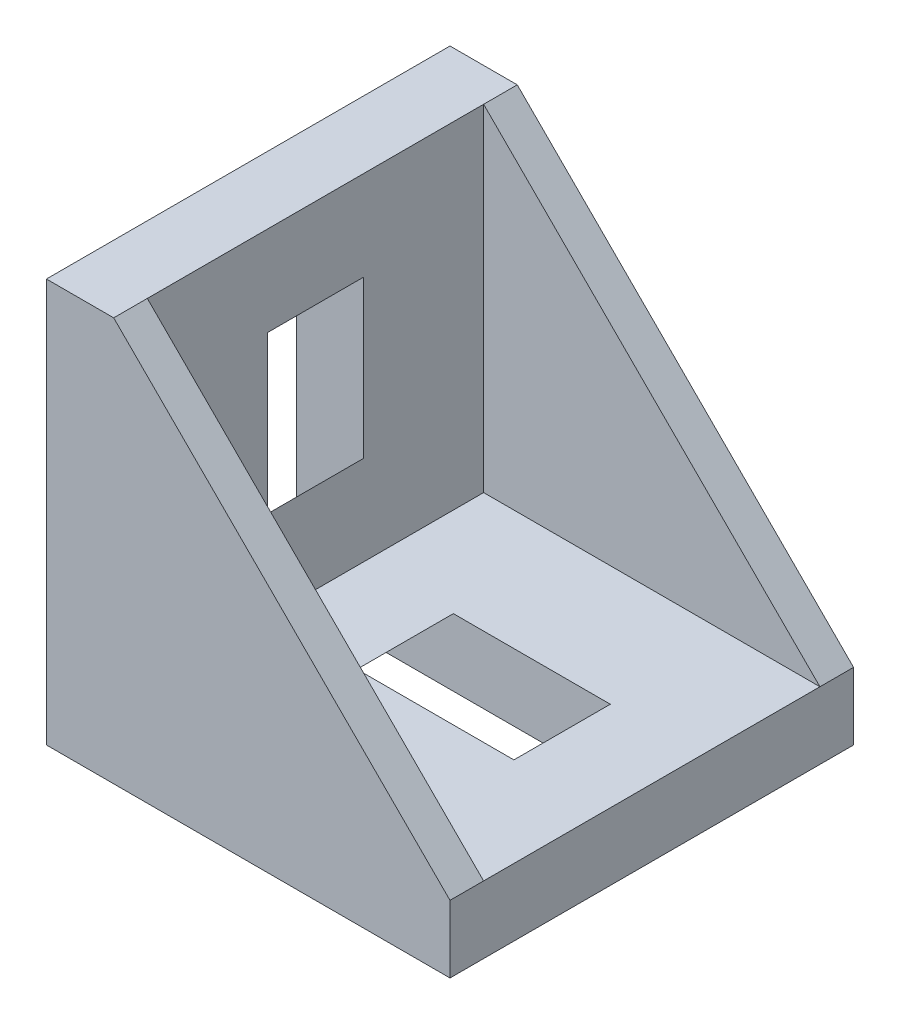
ISO-10303-21;
HEADER;
FILE_DESCRIPTION(('STEP AP214'),'2;1');
FILE_NAME('part.step','',(''),(''),'','','');
FILE_SCHEMA(('AUTOMOTIVE_DESIGN { 1 0 10303 214 1 1 1 1 }'));
ENDSEC;
DATA;
#1=APPLICATION_CONTEXT('core data for automotive mechanical design processes');
#2=APPLICATION_PROTOCOL_DEFINITION('international standard','automotive_design',2000,#1);
#3=PRODUCT_CONTEXT('',#1,'mechanical');
#4=PRODUCT('Part','Part','',(#3));
#5=PRODUCT_RELATED_PRODUCT_CATEGORY('part','',(#4));
#6=PRODUCT_DEFINITION_FORMATION('','',#4);
#7=PRODUCT_DEFINITION_CONTEXT('part definition',#1,'design');
#8=PRODUCT_DEFINITION('design','',#6,#7);
#9=PRODUCT_DEFINITION_SHAPE('','',#8);
#10=(LENGTH_UNIT() NAMED_UNIT(*) SI_UNIT(.MILLI.,.METRE.));
#11=(NAMED_UNIT(*) PLANE_ANGLE_UNIT() SI_UNIT($,.RADIAN.));
#12=(NAMED_UNIT(*) SI_UNIT($,.STERADIAN.) SOLID_ANGLE_UNIT());
#13=UNCERTAINTY_MEASURE_WITH_UNIT(LENGTH_MEASURE(1.E-05),#10,'distance_accuracy_value','');
#14=(GEOMETRIC_REPRESENTATION_CONTEXT(3) GLOBAL_UNCERTAINTY_ASSIGNED_CONTEXT((#13)) GLOBAL_UNIT_ASSIGNED_CONTEXT((#10,
#11,#12)) REPRESENTATION_CONTEXT('',''));
#15=CARTESIAN_POINT('',(0.,0.,0.));
#16=DIRECTION('',(0.,0.,1.));
#17=DIRECTION('',(1.,0.,0.));
#18=AXIS2_PLACEMENT_3D('',#15,#16,#17);
#19=CARTESIAN_POINT('',(0.,0.,9.));
#20=DIRECTION('',(1.,0.,0.));
#21=DIRECTION('',(0.,0.,-1.));
#22=AXIS2_PLACEMENT_3D('',#19,#20,#21);
#23=PLANE('',#22);
#24=DIRECTION('',(0.,0.,-1.));
#25=VECTOR('',#24,1.);
#26=CARTESIAN_POINT('',(0.,17.3,2.5));
#27=LINE('',#26,#25);
#28=CARTESIAN_POINT('',(0.,17.3,2.5));
#29=VERTEX_POINT('',#28);
#30=CARTESIAN_POINT('',(0.,17.3,-2.5));
#31=VERTEX_POINT('',#30);
#32=EDGE_CURVE('E376',#29,#31,#27,.T.);
#33=ORIENTED_EDGE('',*,*,#32,.F.);
#34=DIRECTION('',(0.,1.,0.));
#35=VECTOR('',#34,1.);
#36=CARTESIAN_POINT('',(0.,17.3,2.5));
#37=LINE('',#36,#35);
#38=CARTESIAN_POINT('',(0.,14.9992165715514,2.5));
#39=VERTEX_POINT('',#38);
#40=EDGE_CURVE('E372',#39,#29,#37,.T.);
#41=ORIENTED_EDGE('',*,*,#40,.F.);
#42=DIRECTION('',(0.,0.,-1.));
#43=VECTOR('',#42,1.);
#44=CARTESIAN_POINT('',(0.,14.9992165715514,2.5));
#45=LINE('',#44,#43);
#46=CARTESIAN_POINT('',(0.,14.9992165715514,-2.5));
#47=VERTEX_POINT('',#46);
#48=EDGE_CURVE('E392',#39,#47,#45,.T.);
#49=ORIENTED_EDGE('',*,*,#48,.T.);
#50=DIRECTION('',(0.,1.,0.));
#51=VECTOR('',#50,1.);
#52=CARTESIAN_POINT('',(0.,17.3,-2.5));
#53=LINE('',#52,#51);
#54=EDGE_CURVE('E365',#47,#31,#53,.T.);
#55=ORIENTED_EDGE('',*,*,#54,.T.);
#56=EDGE_LOOP('',(#33,#41,#49,#55));
#57=FACE_BOUND('',#56,.T.);
#58=DIRECTION('',(0.,-1.,0.));
#59=VECTOR('',#58,1.);
#60=CARTESIAN_POINT('',(0.,14.,-2.15));
#61=LINE('',#60,#59);
#62=CARTESIAN_POINT('',(0.,14.,-2.15));
#63=VERTEX_POINT('',#62);
#64=CARTESIAN_POINT('',(0.,4.,-2.15));
#65=VERTEX_POINT('',#64);
#66=EDGE_CURVE('E534',#63,#65,#61,.T.);
#67=ORIENTED_EDGE('',*,*,#66,.F.);
#68=DIRECTION('',(0.,0.,1.));
#69=VECTOR('',#68,1.);
#70=CARTESIAN_POINT('',(0.,14.,-2.15));
#71=LINE('',#70,#69);
#72=CARTESIAN_POINT('',(0.,14.,2.15));
#73=VERTEX_POINT('',#72);
#74=EDGE_CURVE('E565',#63,#73,#71,.T.);
#75=ORIENTED_EDGE('',*,*,#74,.T.);
#76=DIRECTION('',(0.,-1.,0.));
#77=VECTOR('',#76,1.);
#78=CARTESIAN_POINT('',(0.,14.,2.15));
#79=LINE('',#78,#77);
#80=CARTESIAN_POINT('',(0.,4.,2.15));
#81=VERTEX_POINT('',#80);
#82=EDGE_CURVE('E522',#73,#81,#79,.T.);
#83=ORIENTED_EDGE('',*,*,#82,.T.);
#84=DIRECTION('',(0.,0.,1.));
#85=VECTOR('',#84,1.);
#86=CARTESIAN_POINT('',(0.,4.,-2.15));
#87=LINE('',#86,#85);
#88=EDGE_CURVE('E550',#65,#81,#87,.T.);
#89=ORIENTED_EDGE('',*,*,#88,.F.);
#90=EDGE_LOOP('',(#67,#75,#83,#89));
#91=FACE_BOUND('',#90,.T.);
#92=DIRECTION('',(0.,-1.,0.));
#93=VECTOR('',#92,1.);
#94=CARTESIAN_POINT('',(0.,0.,-9.));
#95=LINE('',#94,#93);
#96=CARTESIAN_POINT('',(0.,18.,-9.));
#97=VERTEX_POINT('',#96);
#98=CARTESIAN_POINT('',(0.,0.,-9.));
#99=VERTEX_POINT('',#98);
#100=EDGE_CURVE('E619',#97,#99,#95,.T.);
#101=ORIENTED_EDGE('',*,*,#100,.T.);
#102=DIRECTION('',(0.,0.,-1.));
#103=VECTOR('',#102,1.);
#104=CARTESIAN_POINT('',(0.,0.,9.));
#105=LINE('',#104,#103);
#106=CARTESIAN_POINT('',(0.,0.,9.));
#107=VERTEX_POINT('',#106);
#108=EDGE_CURVE('E631',#107,#99,#105,.T.);
#109=ORIENTED_EDGE('',*,*,#108,.F.);
#110=DIRECTION('',(0.,-1.,0.));
#111=VECTOR('',#110,1.);
#112=CARTESIAN_POINT('',(0.,0.,9.));
#113=LINE('',#112,#111);
#114=CARTESIAN_POINT('',(0.,18.,9.));
#115=VERTEX_POINT('',#114);
#116=EDGE_CURVE('E628',#115,#107,#113,.T.);
#117=ORIENTED_EDGE('',*,*,#116,.F.);
#118=DIRECTION('',(0.,0.,-1.));
#119=VECTOR('',#118,1.);
#120=CARTESIAN_POINT('',(0.,18.,9.));
#121=LINE('',#120,#119);
#122=EDGE_CURVE('E651',#115,#97,#121,.T.);
#123=ORIENTED_EDGE('',*,*,#122,.T.);
#124=EDGE_LOOP('',(#101,#109,#117,#123));
#125=FACE_BOUND('',#124,.T.);
#126=DIRECTION('',(0.,1.,0.));
#127=VECTOR('',#126,1.);
#128=CARTESIAN_POINT('',(0.,1.23475047748417,2.5));
#129=LINE('',#128,#127);
#130=CARTESIAN_POINT('',(0.,1.23475047748417,2.5));
#131=VERTEX_POINT('',#130);
#132=CARTESIAN_POINT('',(0.,3.53553390593273,2.5));
#133=VERTEX_POINT('',#132);
#134=EDGE_CURVE('E404',#131,#133,#129,.T.);
#135=ORIENTED_EDGE('',*,*,#134,.F.);
#136=DIRECTION('',(0.,0.,-1.));
#137=VECTOR('',#136,1.);
#138=CARTESIAN_POINT('',(0.,1.23475047748417,2.5));
#139=LINE('',#138,#137);
#140=CARTESIAN_POINT('',(0.,1.23475047748417,-2.5));
#141=VERTEX_POINT('',#140);
#142=EDGE_CURVE('E418',#131,#141,#139,.T.);
#143=ORIENTED_EDGE('',*,*,#142,.T.);
#144=DIRECTION('',(0.,1.,0.));
#145=VECTOR('',#144,1.);
#146=CARTESIAN_POINT('',(0.,1.23475047748417,-2.5));
#147=LINE('',#146,#145);
#148=CARTESIAN_POINT('',(0.,3.53553390593273,-2.5));
#149=VERTEX_POINT('',#148);
#150=EDGE_CURVE('E403',#141,#149,#147,.T.);
#151=ORIENTED_EDGE('',*,*,#150,.T.);
#152=DIRECTION('',(0.,0.,-1.));
#153=VECTOR('',#152,1.);
#154=CARTESIAN_POINT('',(0.,3.53553390593273,2.5));
#155=LINE('',#154,#153);
#156=EDGE_CURVE('E441',#133,#149,#155,.T.);
#157=ORIENTED_EDGE('',*,*,#156,.F.);
#158=EDGE_LOOP('',(#135,#143,#151,#157));
#159=FACE_BOUND('',#158,.T.);
#160=ADVANCED_FACE('F40',(#57,#91,#125,#159),#23,.F.);
#161=CARTESIAN_POINT('',(18.,0.,9.));
#162=DIRECTION('',(0.,1.,0.));
#163=DIRECTION('',(-1.,0.,0.));
#164=AXIS2_PLACEMENT_3D('',#161,#162,#163);
#165=PLANE('',#164);
#166=DIRECTION('',(0.,0.,-1.));
#167=VECTOR('',#166,1.);
#168=CARTESIAN_POINT('',(14.9992165715514,0.,2.5));
#169=LINE('',#168,#167);
#170=CARTESIAN_POINT('',(14.9992165715514,0.,2.5));
#171=VERTEX_POINT('',#170);
#172=CARTESIAN_POINT('',(14.9992165715514,0.,-2.5));
#173=VERTEX_POINT('',#172);
#174=EDGE_CURVE('E59',#171,#173,#169,.T.);
#175=ORIENTED_EDGE('',*,*,#174,.F.);
#176=DIRECTION('',(-1.,0.,0.));
#177=VECTOR('',#176,1.);
#178=CARTESIAN_POINT('',(17.3,0.,2.5));
#179=LINE('',#178,#177);
#180=CARTESIAN_POINT('',(17.3,0.,2.5));
#181=VERTEX_POINT('',#180);
#182=EDGE_CURVE('E66',#181,#171,#179,.T.);
#183=ORIENTED_EDGE('',*,*,#182,.F.);
#184=DIRECTION('',(0.,0.,-1.));
#185=VECTOR('',#184,1.);
#186=CARTESIAN_POINT('',(17.3,0.,2.5));
#187=LINE('',#186,#185);
#188=CARTESIAN_POINT('',(17.3,0.,-2.5));
#189=VERTEX_POINT('',#188);
#190=EDGE_CURVE('E338',#181,#189,#187,.T.);
#191=ORIENTED_EDGE('',*,*,#190,.T.);
#192=DIRECTION('',(-1.,0.,0.));
#193=VECTOR('',#192,1.);
#194=CARTESIAN_POINT('',(17.3,0.,-2.5));
#195=LINE('',#194,#193);
#196=EDGE_CURVE('E342',#189,#173,#195,.T.);
#197=ORIENTED_EDGE('',*,*,#196,.T.);
#198=EDGE_LOOP('',(#175,#183,#191,#197));
#199=FACE_BOUND('',#198,.T.);
#200=DIRECTION('',(1.,0.,0.));
#201=VECTOR('',#200,1.);
#202=CARTESIAN_POINT('',(4.,0.,-2.15));
#203=LINE('',#202,#201);
#204=CARTESIAN_POINT('',(4.,0.,-2.15));
#205=VERTEX_POINT('',#204);
#206=CARTESIAN_POINT('',(14.,0.,-2.15));
#207=VERTEX_POINT('',#206);
#208=EDGE_CURVE('E491',#205,#207,#203,.T.);
#209=ORIENTED_EDGE('',*,*,#208,.F.);
#210=DIRECTION('',(0.,0.,1.));
#211=VECTOR('',#210,1.);
#212=CARTESIAN_POINT('',(4.,0.,-2.15));
#213=LINE('',#212,#211);
#214=CARTESIAN_POINT('',(4.,0.,2.15));
#215=VERTEX_POINT('',#214);
#216=EDGE_CURVE('E504',#205,#215,#213,.T.);
#217=ORIENTED_EDGE('',*,*,#216,.T.);
#218=DIRECTION('',(1.,0.,0.));
#219=VECTOR('',#218,1.);
#220=CARTESIAN_POINT('',(4.,0.,2.15));
#221=LINE('',#220,#219);
#222=CARTESIAN_POINT('',(14.,0.,2.15));
#223=VERTEX_POINT('',#222);
#224=EDGE_CURVE('E508',#215,#223,#221,.T.);
#225=ORIENTED_EDGE('',*,*,#224,.T.);
#226=DIRECTION('',(0.,0.,1.));
#227=VECTOR('',#226,1.);
#228=CARTESIAN_POINT('',(14.,0.,-2.15));
#229=LINE('',#228,#227);
#230=EDGE_CURVE('E527',#207,#223,#229,.T.);
#231=ORIENTED_EDGE('',*,*,#230,.F.);
#232=EDGE_LOOP('',(#209,#217,#225,#231));
#233=FACE_BOUND('',#232,.T.);
#234=DIRECTION('',(1.,0.,0.));
#235=VECTOR('',#234,1.);
#236=CARTESIAN_POINT('',(18.,0.,-9.));
#237=LINE('',#236,#235);
#238=CARTESIAN_POINT('',(18.,0.,-9.));
#239=VERTEX_POINT('',#238);
#240=EDGE_CURVE('E608',#99,#239,#237,.T.);
#241=ORIENTED_EDGE('',*,*,#240,.T.);
#242=DIRECTION('',(0.,0.,-1.));
#243=VECTOR('',#242,1.);
#244=CARTESIAN_POINT('',(18.,0.,9.));
#245=LINE('',#244,#243);
#246=CARTESIAN_POINT('',(18.,0.,9.));
#247=VERTEX_POINT('',#246);
#248=EDGE_CURVE('E11',#247,#239,#245,.T.);
#249=ORIENTED_EDGE('',*,*,#248,.F.);
#250=DIRECTION('',(1.,0.,0.));
#251=VECTOR('',#250,1.);
#252=CARTESIAN_POINT('',(18.,0.,9.));
#253=LINE('',#252,#251);
#254=EDGE_CURVE('E614',#107,#247,#253,.T.);
#255=ORIENTED_EDGE('',*,*,#254,.F.);
#256=ORIENTED_EDGE('',*,*,#108,.T.);
#257=EDGE_LOOP('',(#241,#249,#255,#256));
#258=FACE_BOUND('',#257,.T.);
#259=DIRECTION('',(-1.,0.,0.));
#260=VECTOR('',#259,1.);
#261=CARTESIAN_POINT('',(1.23475047748409,0.,2.5));
#262=LINE('',#261,#260);
#263=CARTESIAN_POINT('',(3.53553390593274,0.,2.5));
#264=VERTEX_POINT('',#263);
#265=CARTESIAN_POINT('',(1.23475047748409,0.,2.5));
#266=VERTEX_POINT('',#265);
#267=EDGE_CURVE('E448',#264,#266,#262,.T.);
#268=ORIENTED_EDGE('',*,*,#267,.F.);
#269=DIRECTION('',(0.,0.,-1.));
#270=VECTOR('',#269,1.);
#271=CARTESIAN_POINT('',(3.53553390593274,0.,2.5));
#272=LINE('',#271,#270);
#273=CARTESIAN_POINT('',(3.53553390593274,0.,-2.5));
#274=VERTEX_POINT('',#273);
#275=EDGE_CURVE('E482',#264,#274,#272,.T.);
#276=ORIENTED_EDGE('',*,*,#275,.T.);
#277=DIRECTION('',(-1.,0.,0.));
#278=VECTOR('',#277,1.);
#279=CARTESIAN_POINT('',(1.23475047748409,0.,-2.5));
#280=LINE('',#279,#278);
#281=CARTESIAN_POINT('',(1.23475047748409,0.,-2.5));
#282=VERTEX_POINT('',#281);
#283=EDGE_CURVE('E462',#274,#282,#280,.T.);
#284=ORIENTED_EDGE('',*,*,#283,.T.);
#285=DIRECTION('',(0.,0.,-1.));
#286=VECTOR('',#285,1.);
#287=CARTESIAN_POINT('',(1.23475047748409,0.,2.5));
#288=LINE('',#287,#286);
#289=EDGE_CURVE('E478',#266,#282,#288,.T.);
#290=ORIENTED_EDGE('',*,*,#289,.F.);
#291=EDGE_LOOP('',(#268,#276,#284,#290));
#292=FACE_BOUND('',#291,.T.);
#293=ADVANCED_FACE('F42',(#199,#233,#258,#292),#165,.F.);
#294=CARTESIAN_POINT('',(3.,3.,-7.5));
#295=DIRECTION('',(0.,-1.,0.));
#296=DIRECTION('',(0.,0.,-1.));
#297=AXIS2_PLACEMENT_3D('',#294,#295,#296);
#298=PLANE('',#297);
#299=DIRECTION('',(1.,0.,0.));
#300=VECTOR('',#299,1.);
#301=CARTESIAN_POINT('',(3.,3.,7.5));
#302=LINE('',#301,#300);
#303=CARTESIAN_POINT('',(3.,3.,7.5));
#304=VERTEX_POINT('',#303);
#305=CARTESIAN_POINT('',(18.,3.,7.5));
#306=VERTEX_POINT('',#305);
#307=EDGE_CURVE('E585',#304,#306,#302,.T.);
#308=ORIENTED_EDGE('',*,*,#307,.T.);
#309=DIRECTION('',(0.,0.,1.));
#310=VECTOR('',#309,1.);
#311=CARTESIAN_POINT('',(18.,3.,-7.5));
#312=LINE('',#311,#310);
#313=CARTESIAN_POINT('',(18.,3.,-7.5));
#314=VERTEX_POINT('',#313);
#315=EDGE_CURVE('E604',#314,#306,#312,.T.);
#316=ORIENTED_EDGE('',*,*,#315,.F.);
#317=DIRECTION('',(1.,0.,0.));
#318=VECTOR('',#317,1.);
#319=CARTESIAN_POINT('',(3.,3.,-7.5));
#320=LINE('',#319,#318);
#321=CARTESIAN_POINT('',(3.,3.,-7.5));
#322=VERTEX_POINT('',#321);
#323=EDGE_CURVE('E589',#322,#314,#320,.T.);
#324=ORIENTED_EDGE('',*,*,#323,.F.);
#325=DIRECTION('',(0.,0.,1.));
#326=VECTOR('',#325,1.);
#327=CARTESIAN_POINT('',(3.,3.,-7.5));
#328=LINE('',#327,#326);
#329=EDGE_CURVE('E609',#322,#304,#328,.T.);
#330=ORIENTED_EDGE('',*,*,#329,.T.);
#331=EDGE_LOOP('',(#308,#316,#324,#330));
#332=FACE_BOUND('',#331,.T.);
#333=DIRECTION('',(-1.,0.,0.));
#334=VECTOR('',#333,1.);
#335=CARTESIAN_POINT('',(7.,3.,-2.15));
#336=LINE('',#335,#334);
#337=CARTESIAN_POINT('',(14.,3.,-2.15));
#338=VERTEX_POINT('',#337);
#339=CARTESIAN_POINT('',(7.,3.,-2.15));
#340=VERTEX_POINT('',#339);
#341=EDGE_CURVE('E500',#338,#340,#336,.T.);
#342=ORIENTED_EDGE('',*,*,#341,.F.);
#343=DIRECTION('',(0.,0.,1.));
#344=VECTOR('',#343,1.);
#345=CARTESIAN_POINT('',(14.,3.,-2.15));
#346=LINE('',#345,#344);
#347=CARTESIAN_POINT('',(14.,3.,2.15));
#348=VERTEX_POINT('',#347);
#349=EDGE_CURVE('E523',#338,#348,#346,.T.);
#350=ORIENTED_EDGE('',*,*,#349,.T.);
#351=DIRECTION('',(-1.,0.,0.));
#352=VECTOR('',#351,1.);
#353=CARTESIAN_POINT('',(7.,3.,2.15));
#354=LINE('',#353,#352);
#355=CARTESIAN_POINT('',(7.,3.,2.15));
#356=VERTEX_POINT('',#355);
#357=EDGE_CURVE('E492',#348,#356,#354,.T.);
#358=ORIENTED_EDGE('',*,*,#357,.T.);
#359=DIRECTION('',(0.,0.,1.));
#360=VECTOR('',#359,1.);
#361=CARTESIAN_POINT('',(7.,3.,-2.15));
#362=LINE('',#361,#360);
#363=EDGE_CURVE('E518',#340,#356,#362,.T.);
#364=ORIENTED_EDGE('',*,*,#363,.F.);
#365=EDGE_LOOP('',(#342,#350,#358,#364));
#366=FACE_BOUND('',#365,.T.);
#367=ADVANCED_FACE('F699',(#332,#366),#298,.F.);
#368=CARTESIAN_POINT('',(3.,18.,-7.5));
#369=DIRECTION('',(-1.,0.,0.));
#370=DIRECTION('',(0.,-1.,0.));
#371=AXIS2_PLACEMENT_3D('',#368,#369,#370);
#372=PLANE('',#371);
#373=DIRECTION('',(0.,-1.,0.));
#374=VECTOR('',#373,1.);
#375=CARTESIAN_POINT('',(3.,18.,7.5));
#376=LINE('',#375,#374);
#377=CARTESIAN_POINT('',(3.,18.,7.5));
#378=VERTEX_POINT('',#377);
#379=EDGE_CURVE('E597',#378,#304,#376,.T.);
#380=ORIENTED_EDGE('',*,*,#379,.T.);
#381=ORIENTED_EDGE('',*,*,#329,.F.);
#382=DIRECTION('',(0.,-1.,0.));
#383=VECTOR('',#382,1.);
#384=CARTESIAN_POINT('',(3.,18.,-7.5));
#385=LINE('',#384,#383);
#386=CARTESIAN_POINT('',(3.,18.,-7.5));
#387=VERTEX_POINT('',#386);
#388=EDGE_CURVE('E584',#387,#322,#385,.T.);
#389=ORIENTED_EDGE('',*,*,#388,.F.);
#390=DIRECTION('',(0.,0.,1.));
#391=VECTOR('',#390,1.);
#392=CARTESIAN_POINT('',(3.,18.,-7.5));
#393=LINE('',#392,#391);
#394=EDGE_CURVE('E593',#387,#378,#393,.T.);
#395=ORIENTED_EDGE('',*,*,#394,.T.);
#396=EDGE_LOOP('',(#380,#381,#389,#395));
#397=FACE_BOUND('',#396,.T.);
#398=DIRECTION('',(0.,1.,0.));
#399=VECTOR('',#398,1.);
#400=CARTESIAN_POINT('',(3.,14.,-2.15));
#401=LINE('',#400,#399);
#402=CARTESIAN_POINT('',(3.,7.,-2.15));
#403=VERTEX_POINT('',#402);
#404=CARTESIAN_POINT('',(3.,14.,-2.15));
#405=VERTEX_POINT('',#404);
#406=EDGE_CURVE('E543',#403,#405,#401,.T.);
#407=ORIENTED_EDGE('',*,*,#406,.F.);
#408=DIRECTION('',(0.,0.,1.));
#409=VECTOR('',#408,1.);
#410=CARTESIAN_POINT('',(3.,7.,-2.15));
#411=LINE('',#410,#409);
#412=CARTESIAN_POINT('',(3.,7.,2.15));
#413=VERTEX_POINT('',#412);
#414=EDGE_CURVE('E574',#403,#413,#411,.T.);
#415=ORIENTED_EDGE('',*,*,#414,.T.);
#416=DIRECTION('',(0.,1.,0.));
#417=VECTOR('',#416,1.);
#418=CARTESIAN_POINT('',(3.,14.,2.15));
#419=LINE('',#418,#417);
#420=CARTESIAN_POINT('',(3.,14.,2.15));
#421=VERTEX_POINT('',#420);
#422=EDGE_CURVE('E558',#413,#421,#419,.T.);
#423=ORIENTED_EDGE('',*,*,#422,.T.);
#424=DIRECTION('',(0.,0.,1.));
#425=VECTOR('',#424,1.);
#426=CARTESIAN_POINT('',(3.,14.,-2.15));
#427=LINE('',#426,#425);
#428=EDGE_CURVE('E570',#405,#421,#427,.T.);
#429=ORIENTED_EDGE('',*,*,#428,.F.);
#430=EDGE_LOOP('',(#407,#415,#423,#429));
#431=FACE_BOUND('',#430,.T.);
#432=ADVANCED_FACE('F704',(#397,#431),#372,.F.);
#433=CARTESIAN_POINT('',(18.,3.,9.));
#434=DIRECTION('',(-0.707106781186547,-0.707106781186547,0.));
#435=DIRECTION('',(0.707106781186548,-0.707106781186548,0.));
#436=AXIS2_PLACEMENT_3D('',#433,#434,#435);
#437=PLANE('',#436);
#438=DIRECTION('',(-0.707106781186547,0.707106781186547,0.));
#439=VECTOR('',#438,1.);
#440=CARTESIAN_POINT('',(3.,18.,-7.5));
#441=LINE('',#440,#439);
#442=EDGE_CURVE('E581',#314,#387,#441,.T.);
#443=ORIENTED_EDGE('',*,*,#442,.F.);
#444=DIRECTION('',(0.,0.,-1.));
#445=VECTOR('',#444,1.);
#446=CARTESIAN_POINT('',(18.,3.,9.));
#447=LINE('',#446,#445);
#448=CARTESIAN_POINT('',(18.,3.,-9.));
#449=VERTEX_POINT('',#448);
#450=EDGE_CURVE('E659',#314,#449,#447,.T.);
#451=ORIENTED_EDGE('',*,*,#450,.T.);
#452=DIRECTION('',(-0.707106781186547,0.707106781186547,0.));
#453=VECTOR('',#452,1.);
#454=CARTESIAN_POINT('',(18.,3.,-9.));
#455=LINE('',#454,#453);
#456=CARTESIAN_POINT('',(3.,18.,-9.));
#457=VERTEX_POINT('',#456);
#458=EDGE_CURVE('E639',#449,#457,#455,.T.);
#459=ORIENTED_EDGE('',*,*,#458,.T.);
#460=DIRECTION('',(0.,0.,-1.));
#461=VECTOR('',#460,1.);
#462=CARTESIAN_POINT('',(3.,18.,9.));
#463=LINE('',#462,#461);
#464=EDGE_CURVE('E655',#387,#457,#463,.T.);
#465=ORIENTED_EDGE('',*,*,#464,.F.);
#466=EDGE_LOOP('',(#443,#451,#459,#465));
#467=FACE_BOUND('',#466,.T.);
#468=ADVANCED_FACE('F669',(#467),#437,.F.);
#469=CARTESIAN_POINT('',(18.,3.,9.));
#470=DIRECTION('',(-1.,0.,0.));
#471=DIRECTION('',(0.,0.,1.));
#472=AXIS2_PLACEMENT_3D('',#469,#470,#471);
#473=PLANE('',#472);
#474=DIRECTION('',(0.,1.,0.));
#475=VECTOR('',#474,1.);
#476=CARTESIAN_POINT('',(18.,3.,-9.));
#477=LINE('',#476,#475);
#478=EDGE_CURVE('E635',#239,#449,#477,.T.);
#479=ORIENTED_EDGE('',*,*,#478,.T.);
#480=ORIENTED_EDGE('',*,*,#450,.F.);
#481=ORIENTED_EDGE('',*,*,#315,.T.);
#482=CARTESIAN_POINT('',(18.,3.,9.));
#483=VERTEX_POINT('',#482);
#484=EDGE_CURVE('E49',#483,#306,#447,.T.);
#485=ORIENTED_EDGE('',*,*,#484,.F.);
#486=DIRECTION('',(0.,1.,0.));
#487=VECTOR('',#486,1.);
#488=CARTESIAN_POINT('',(18.,3.,9.));
#489=LINE('',#488,#487);
#490=EDGE_CURVE('E618',#247,#483,#489,.T.);
#491=ORIENTED_EDGE('',*,*,#490,.F.);
#492=ORIENTED_EDGE('',*,*,#248,.T.);
#493=EDGE_LOOP('',(#479,#480,#481,#485,#491,#492));
#494=FACE_BOUND('',#493,.T.);
#495=ADVANCED_FACE('F674',(#494),#473,.F.);
#496=ORIENTED_EDGE('',*,*,#484,.T.);
#497=DIRECTION('',(-0.707106781186547,0.707106781186547,0.));
#498=VECTOR('',#497,1.);
#499=CARTESIAN_POINT('',(3.,18.,7.5));
#500=LINE('',#499,#498);
#501=EDGE_CURVE('E569',#306,#378,#500,.T.);
#502=ORIENTED_EDGE('',*,*,#501,.T.);
#503=CARTESIAN_POINT('',(3.,18.,9.));
#504=VERTEX_POINT('',#503);
#505=EDGE_CURVE('E656',#504,#378,#463,.T.);
#506=ORIENTED_EDGE('',*,*,#505,.F.);
#507=DIRECTION('',(-0.707106781186547,0.707106781186547,0.));
#508=VECTOR('',#507,1.);
#509=CARTESIAN_POINT('',(18.,3.,9.));
#510=LINE('',#509,#508);
#511=EDGE_CURVE('E622',#483,#504,#510,.T.);
#512=ORIENTED_EDGE('',*,*,#511,.F.);
#513=EDGE_LOOP('',(#496,#502,#506,#512));
#514=FACE_BOUND('',#513,.T.);
#515=ADVANCED_FACE('F693',(#514),#437,.F.);
#516=CARTESIAN_POINT('',(3.,18.,9.));
#517=DIRECTION('',(0.,-1.,0.));
#518=DIRECTION('',(0.,0.,-1.));
#519=AXIS2_PLACEMENT_3D('',#516,#517,#518);
#520=PLANE('',#519);
#521=DIRECTION('',(-1.,0.,0.));
#522=VECTOR('',#521,1.);
#523=CARTESIAN_POINT('',(3.,18.,-9.));
#524=LINE('',#523,#522);
#525=EDGE_CURVE('E643',#457,#97,#524,.T.);
#526=ORIENTED_EDGE('',*,*,#525,.T.);
#527=ORIENTED_EDGE('',*,*,#122,.F.);
#528=DIRECTION('',(-1.,0.,0.));
#529=VECTOR('',#528,1.);
#530=CARTESIAN_POINT('',(3.,18.,9.));
#531=LINE('',#530,#529);
#532=EDGE_CURVE('E625',#504,#115,#531,.T.);
#533=ORIENTED_EDGE('',*,*,#532,.F.);
#534=ORIENTED_EDGE('',*,*,#505,.T.);
#535=ORIENTED_EDGE('',*,*,#394,.F.);
#536=ORIENTED_EDGE('',*,*,#464,.T.);
#537=EDGE_LOOP('',(#526,#527,#533,#534,#535,#536));
#538=FACE_BOUND('',#537,.T.);
#539=ADVANCED_FACE('F682',(#538),#520,.F.);
#540=CARTESIAN_POINT('',(0.,0.,9.));
#541=DIRECTION('',(0.,0.,-1.));
#542=DIRECTION('',(-1.,0.,0.));
#543=AXIS2_PLACEMENT_3D('',#540,#541,#542);
#544=PLANE('',#543);
#545=ORIENTED_EDGE('',*,*,#254,.T.);
#546=ORIENTED_EDGE('',*,*,#490,.T.);
#547=ORIENTED_EDGE('',*,*,#511,.T.);
#548=ORIENTED_EDGE('',*,*,#532,.T.);
#549=ORIENTED_EDGE('',*,*,#116,.T.);
#550=EDGE_LOOP('',(#545,#546,#547,#548,#549));
#551=FACE_BOUND('',#550,.T.);
#552=ADVANCED_FACE('F691',(#551),#544,.F.);
#553=CARTESIAN_POINT('',(0.,0.,-9.));
#554=DIRECTION('',(0.,0.,-1.));
#555=DIRECTION('',(-1.,0.,0.));
#556=AXIS2_PLACEMENT_3D('',#553,#554,#555);
#557=PLANE('',#556);
#558=ORIENTED_EDGE('',*,*,#240,.F.);
#559=ORIENTED_EDGE('',*,*,#100,.F.);
#560=ORIENTED_EDGE('',*,*,#525,.F.);
#561=ORIENTED_EDGE('',*,*,#458,.F.);
#562=ORIENTED_EDGE('',*,*,#478,.F.);
#563=EDGE_LOOP('',(#558,#559,#560,#561,#562));
#564=FACE_BOUND('',#563,.T.);
#565=ADVANCED_FACE('F678',(#564),#557,.T.);
#566=CARTESIAN_POINT('',(18.,3.,-7.5));
#567=DIRECTION('',(0.,0.,1.));
#568=DIRECTION('',(1.,0.,0.));
#569=AXIS2_PLACEMENT_3D('',#566,#567,#568);
#570=PLANE('',#569);
#571=ORIENTED_EDGE('',*,*,#442,.T.);
#572=ORIENTED_EDGE('',*,*,#388,.T.);
#573=ORIENTED_EDGE('',*,*,#323,.T.);
#574=EDGE_LOOP('',(#571,#572,#573));
#575=FACE_BOUND('',#574,.T.);
#576=ADVANCED_FACE('F708',(#575),#570,.T.);
#577=CARTESIAN_POINT('',(18.,3.,7.5));
#578=DIRECTION('',(0.,0.,1.));
#579=DIRECTION('',(1.,0.,0.));
#580=AXIS2_PLACEMENT_3D('',#577,#578,#579);
#581=PLANE('',#580);
#582=ORIENTED_EDGE('',*,*,#501,.F.);
#583=ORIENTED_EDGE('',*,*,#307,.F.);
#584=ORIENTED_EDGE('',*,*,#379,.F.);
#585=EDGE_LOOP('',(#582,#583,#584));
#586=FACE_BOUND('',#585,.T.);
#587=ADVANCED_FACE('F697',(#586),#581,.F.);
#588=CARTESIAN_POINT('',(0.,14.,-2.15));
#589=DIRECTION('',(0.,1.,0.));
#590=DIRECTION('',(0.,0.,1.));
#591=AXIS2_PLACEMENT_3D('',#588,#589,#590);
#592=PLANE('',#591);
#593=DIRECTION('',(-1.,0.,0.));
#594=VECTOR('',#593,1.);
#595=CARTESIAN_POINT('',(0.,14.,2.15));
#596=LINE('',#595,#594);
#597=EDGE_CURVE('E539',#421,#73,#596,.T.);
#598=ORIENTED_EDGE('',*,*,#597,.T.);
#599=ORIENTED_EDGE('',*,*,#74,.F.);
#600=DIRECTION('',(-1.,0.,0.));
#601=VECTOR('',#600,1.);
#602=CARTESIAN_POINT('',(0.,14.,-2.15));
#603=LINE('',#602,#601);
#604=EDGE_CURVE('E546',#405,#63,#603,.T.);
#605=ORIENTED_EDGE('',*,*,#604,.F.);
#606=ORIENTED_EDGE('',*,*,#428,.T.);
#607=EDGE_LOOP('',(#598,#599,#605,#606));
#608=FACE_BOUND('',#607,.T.);
#609=ADVANCED_FACE('F715',(#608),#592,.F.);
#610=CARTESIAN_POINT('',(0.,4.,-2.15));
#611=DIRECTION('',(0.707106781186548,-0.707106781186547,0.));
#612=DIRECTION('',(0.707106781186547,0.707106781186548,0.));
#613=AXIS2_PLACEMENT_3D('',#610,#611,#612);
#614=PLANE('',#613);
#615=DIRECTION('',(0.707106781186547,0.707106781186548,0.));
#616=VECTOR('',#615,1.);
#617=CARTESIAN_POINT('',(0.,4.,2.15));
#618=LINE('',#617,#616);
#619=EDGE_CURVE('E554',#81,#413,#618,.T.);
#620=ORIENTED_EDGE('',*,*,#619,.T.);
#621=ORIENTED_EDGE('',*,*,#414,.F.);
#622=DIRECTION('',(0.707106781186547,0.707106781186548,0.));
#623=VECTOR('',#622,1.);
#624=CARTESIAN_POINT('',(0.,4.,-2.15));
#625=LINE('',#624,#623);
#626=EDGE_CURVE('E538',#65,#403,#625,.T.);
#627=ORIENTED_EDGE('',*,*,#626,.F.);
#628=ORIENTED_EDGE('',*,*,#88,.T.);
#629=EDGE_LOOP('',(#620,#621,#627,#628));
#630=FACE_BOUND('',#629,.T.);
#631=ADVANCED_FACE('F784',(#630),#614,.F.);
#632=CARTESIAN_POINT('',(0.,14.,-2.15));
#633=DIRECTION('',(0.,0.,1.));
#634=DIRECTION('',(1.,0.,0.));
#635=AXIS2_PLACEMENT_3D('',#632,#633,#634);
#636=PLANE('',#635);
#637=ORIENTED_EDGE('',*,*,#66,.T.);
#638=ORIENTED_EDGE('',*,*,#626,.T.);
#639=ORIENTED_EDGE('',*,*,#406,.T.);
#640=ORIENTED_EDGE('',*,*,#604,.T.);
#641=EDGE_LOOP('',(#637,#638,#639,#640));
#642=FACE_BOUND('',#641,.T.);
#643=ADVANCED_FACE('F794',(#642),#636,.T.);
#644=CARTESIAN_POINT('',(0.,14.,2.15));
#645=DIRECTION('',(0.,0.,1.));
#646=DIRECTION('',(1.,0.,0.));
#647=AXIS2_PLACEMENT_3D('',#644,#645,#646);
#648=PLANE('',#647);
#649=ORIENTED_EDGE('',*,*,#82,.F.);
#650=ORIENTED_EDGE('',*,*,#597,.F.);
#651=ORIENTED_EDGE('',*,*,#422,.F.);
#652=ORIENTED_EDGE('',*,*,#619,.F.);
#653=EDGE_LOOP('',(#649,#650,#651,#652));
#654=FACE_BOUND('',#653,.T.);
#655=ADVANCED_FACE('F803',(#654),#648,.F.);
#656=CARTESIAN_POINT('',(7.,3.,-2.15));
#657=DIRECTION('',(-0.707106781186548,0.707106781186547,0.));
#658=DIRECTION('',(-0.707106781186547,-0.707106781186548,0.));
#659=AXIS2_PLACEMENT_3D('',#656,#657,#658);
#660=PLANE('',#659);
#661=DIRECTION('',(-0.707106781186547,-0.707106781186548,0.));
#662=VECTOR('',#661,1.);
#663=CARTESIAN_POINT('',(7.,3.,2.15));
#664=LINE('',#663,#662);
#665=EDGE_CURVE('E486',#356,#215,#664,.T.);
#666=ORIENTED_EDGE('',*,*,#665,.T.);
#667=ORIENTED_EDGE('',*,*,#216,.F.);
#668=DIRECTION('',(-0.707106781186547,-0.707106781186548,0.));
#669=VECTOR('',#668,1.);
#670=CARTESIAN_POINT('',(7.,3.,-2.15));
#671=LINE('',#670,#669);
#672=EDGE_CURVE('E487',#340,#205,#671,.T.);
#673=ORIENTED_EDGE('',*,*,#672,.F.);
#674=ORIENTED_EDGE('',*,*,#363,.T.);
#675=EDGE_LOOP('',(#666,#667,#673,#674));
#676=FACE_BOUND('',#675,.T.);
#677=ADVANCED_FACE('F813',(#676),#660,.F.);
#678=CARTESIAN_POINT('',(14.,3.,-2.15));
#679=DIRECTION('',(1.,0.,0.));
#680=DIRECTION('',(0.,0.,-1.));
#681=AXIS2_PLACEMENT_3D('',#678,#679,#680);
#682=PLANE('',#681);
#683=DIRECTION('',(0.,1.,0.));
#684=VECTOR('',#683,1.);
#685=CARTESIAN_POINT('',(14.,3.,2.15));
#686=LINE('',#685,#684);
#687=EDGE_CURVE('E512',#223,#348,#686,.T.);
#688=ORIENTED_EDGE('',*,*,#687,.T.);
#689=ORIENTED_EDGE('',*,*,#349,.F.);
#690=DIRECTION('',(0.,1.,0.));
#691=VECTOR('',#690,1.);
#692=CARTESIAN_POINT('',(14.,3.,-2.15));
#693=LINE('',#692,#691);
#694=EDGE_CURVE('E496',#207,#338,#693,.T.);
#695=ORIENTED_EDGE('',*,*,#694,.F.);
#696=ORIENTED_EDGE('',*,*,#230,.T.);
#697=EDGE_LOOP('',(#688,#689,#695,#696));
#698=FACE_BOUND('',#697,.T.);
#699=ADVANCED_FACE('F757',(#698),#682,.F.);
#700=CARTESIAN_POINT('',(4.,0.,-2.15));
#701=DIRECTION('',(0.,0.,1.));
#702=DIRECTION('',(1.,0.,0.));
#703=AXIS2_PLACEMENT_3D('',#700,#701,#702);
#704=PLANE('',#703);
#705=ORIENTED_EDGE('',*,*,#672,.T.);
#706=ORIENTED_EDGE('',*,*,#208,.T.);
#707=ORIENTED_EDGE('',*,*,#694,.T.);
#708=ORIENTED_EDGE('',*,*,#341,.T.);
#709=EDGE_LOOP('',(#705,#706,#707,#708));
#710=FACE_BOUND('',#709,.T.);
#711=ADVANCED_FACE('F829',(#710),#704,.T.);
#712=CARTESIAN_POINT('',(4.,0.,2.15));
#713=DIRECTION('',(0.,0.,1.));
#714=DIRECTION('',(1.,0.,0.));
#715=AXIS2_PLACEMENT_3D('',#712,#713,#714);
#716=PLANE('',#715);
#717=ORIENTED_EDGE('',*,*,#665,.F.);
#718=ORIENTED_EDGE('',*,*,#357,.F.);
#719=ORIENTED_EDGE('',*,*,#687,.F.);
#720=ORIENTED_EDGE('',*,*,#224,.F.);
#721=EDGE_LOOP('',(#717,#718,#719,#720));
#722=FACE_BOUND('',#721,.T.);
#723=ADVANCED_FACE('F838',(#722),#716,.F.);
#724=CARTESIAN_POINT('',(3.53553390593274,0.,2.5));
#725=DIRECTION('',(-0.663272861612076,0.748377652692094,0.));
#726=DIRECTION('',(-0.748377652692093,-0.663272861612076,0.));
#727=AXIS2_PLACEMENT_3D('',#724,#725,#726);
#728=PLANE('',#727);
#729=DIRECTION('',(0.748377652692093,0.663272861612076,0.));
#730=VECTOR('',#729,1.);
#731=CARTESIAN_POINT('',(3.53553390593274,0.,-2.5));
#732=LINE('',#731,#730);
#733=CARTESIAN_POINT('',(1.50457522691833,-1.8,-2.5));
#734=VERTEX_POINT('',#733);
#735=EDGE_CURVE('E444',#734,#274,#732,.T.);
#736=ORIENTED_EDGE('',*,*,#735,.T.);
#737=ORIENTED_EDGE('',*,*,#275,.F.);
#738=DIRECTION('',(0.748377652692093,0.663272861612076,0.));
#739=VECTOR('',#738,1.);
#740=CARTESIAN_POINT('',(3.53553390593274,0.,2.5));
#741=LINE('',#740,#739);
#742=CARTESIAN_POINT('',(1.50457522691833,-1.8,2.5));
#743=VERTEX_POINT('',#742);
#744=EDGE_CURVE('E445',#743,#264,#741,.T.);
#745=ORIENTED_EDGE('',*,*,#744,.F.);
#746=DIRECTION('',(0.,0.,-1.));
#747=VECTOR('',#746,1.);
#748=CARTESIAN_POINT('',(1.50457522691833,-1.8,2.5));
#749=LINE('',#748,#747);
#750=EDGE_CURVE('E458',#743,#734,#749,.T.);
#751=ORIENTED_EDGE('',*,*,#750,.T.);
#752=EDGE_LOOP('',(#736,#737,#745,#751));
#753=FACE_BOUND('',#752,.T.);
#754=ADVANCED_FACE('F847',(#753),#728,.F.);
#755=CARTESIAN_POINT('',(0.511249685150937,-0.790946088307917,2.5));
#756=DIRECTION('',(0.737866149456581,-0.674947068655105,0.));
#757=DIRECTION('',(0.674947068655105,0.737866149456581,0.));
#758=AXIS2_PLACEMENT_3D('',#755,#756,#757);
#759=PLANE('',#758);
#760=DIRECTION('',(-0.674947068655105,-0.737866149456581,0.));
#761=VECTOR('',#760,1.);
#762=CARTESIAN_POINT('',(0.511249685150937,-0.790946088307917,-2.5));
#763=LINE('',#762,#761);
#764=CARTESIAN_POINT('',(0.511249685150937,-0.790946088307917,-2.5));
#765=VERTEX_POINT('',#764);
#766=EDGE_CURVE('E466',#282,#765,#763,.T.);
#767=ORIENTED_EDGE('',*,*,#766,.T.);
#768=DIRECTION('',(0.,0.,-1.));
#769=VECTOR('',#768,1.);
#770=CARTESIAN_POINT('',(0.511249685150937,-0.790946088307917,2.5));
#771=LINE('',#770,#769);
#772=CARTESIAN_POINT('',(0.511249685150937,-0.790946088307917,2.5));
#773=VERTEX_POINT('',#772);
#774=EDGE_CURVE('E474',#773,#765,#771,.T.);
#775=ORIENTED_EDGE('',*,*,#774,.F.);
#776=DIRECTION('',(-0.674947068655105,-0.737866149456581,0.));
#777=VECTOR('',#776,1.);
#778=CARTESIAN_POINT('',(0.511249685150937,-0.790946088307917,2.5));
#779=LINE('',#778,#777);
#780=EDGE_CURVE('E452',#266,#773,#779,.T.);
#781=ORIENTED_EDGE('',*,*,#780,.F.);
#782=ORIENTED_EDGE('',*,*,#289,.T.);
#783=EDGE_LOOP('',(#767,#775,#781,#782));
#784=FACE_BOUND('',#783,.T.);
#785=ADVANCED_FACE('F868',(#784),#759,.F.);
#786=CARTESIAN_POINT('',(1.50457522691833,-1.8,2.5));
#787=DIRECTION('',(0.71263900766616,0.701530929291496,0.));
#788=DIRECTION('',(-0.701530929291496,0.71263900766616,0.));
#789=AXIS2_PLACEMENT_3D('',#786,#787,#788);
#790=PLANE('',#789);
#791=DIRECTION('',(0.701530929291496,-0.71263900766616,0.));
#792=VECTOR('',#791,1.);
#793=CARTESIAN_POINT('',(1.50457522691833,-1.8,-2.5));
#794=LINE('',#793,#792);
#795=EDGE_CURVE('E449',#765,#734,#794,.T.);
#796=ORIENTED_EDGE('',*,*,#795,.T.);
#797=ORIENTED_EDGE('',*,*,#750,.F.);
#798=DIRECTION('',(0.701530929291496,-0.71263900766616,0.));
#799=VECTOR('',#798,1.);
#800=CARTESIAN_POINT('',(1.50457522691833,-1.8,2.5));
#801=LINE('',#800,#799);
#802=EDGE_CURVE('E455',#773,#743,#801,.T.);
#803=ORIENTED_EDGE('',*,*,#802,.F.);
#804=ORIENTED_EDGE('',*,*,#774,.T.);
#805=EDGE_LOOP('',(#796,#797,#803,#804));
#806=FACE_BOUND('',#805,.T.);
#807=ADVANCED_FACE('F878',(#806),#790,.F.);
#808=CARTESIAN_POINT('',(1.50457522691833,-1.8,2.5));
#809=DIRECTION('',(0.,0.,-1.));
#810=DIRECTION('',(-1.,0.,0.));
#811=AXIS2_PLACEMENT_3D('',#808,#809,#810);
#812=PLANE('',#811);
#813=ORIENTED_EDGE('',*,*,#744,.T.);
#814=ORIENTED_EDGE('',*,*,#267,.T.);
#815=ORIENTED_EDGE('',*,*,#780,.T.);
#816=ORIENTED_EDGE('',*,*,#802,.T.);
#817=EDGE_LOOP('',(#813,#814,#815,#816));
#818=FACE_BOUND('',#817,.T.);
#819=ADVANCED_FACE('F888',(#818),#812,.F.);
#820=CARTESIAN_POINT('',(1.50457522691833,-1.8,-2.5));
#821=DIRECTION('',(0.,0.,-1.));
#822=DIRECTION('',(-1.,0.,0.));
#823=AXIS2_PLACEMENT_3D('',#820,#821,#822);
#824=PLANE('',#823);
#825=ORIENTED_EDGE('',*,*,#735,.F.);
#826=ORIENTED_EDGE('',*,*,#795,.F.);
#827=ORIENTED_EDGE('',*,*,#766,.F.);
#828=ORIENTED_EDGE('',*,*,#283,.F.);
#829=EDGE_LOOP('',(#825,#826,#827,#828));
#830=FACE_BOUND('',#829,.T.);
#831=ADVANCED_FACE('F898',(#830),#824,.T.);
#832=CARTESIAN_POINT('',(0.,3.53553390593273,2.5));
#833=DIRECTION('',(0.748377652692093,-0.663272861612077,0.));
#834=DIRECTION('',(0.663272861612077,0.748377652692093,0.));
#835=AXIS2_PLACEMENT_3D('',#832,#833,#834);
#836=PLANE('',#835);
#837=DIRECTION('',(-0.663272861612077,-0.748377652692093,0.));
#838=VECTOR('',#837,1.);
#839=CARTESIAN_POINT('',(0.,3.53553390593273,-2.5));
#840=LINE('',#839,#838);
#841=CARTESIAN_POINT('',(-1.8,1.50457522691833,-2.5));
#842=VERTEX_POINT('',#841);
#843=EDGE_CURVE('E422',#149,#842,#840,.T.);
#844=ORIENTED_EDGE('',*,*,#843,.T.);
#845=DIRECTION('',(0.,0.,-1.));
#846=VECTOR('',#845,1.);
#847=CARTESIAN_POINT('',(-1.8,1.50457522691833,2.5));
#848=LINE('',#847,#846);
#849=CARTESIAN_POINT('',(-1.8,1.50457522691833,2.5));
#850=VERTEX_POINT('',#849);
#851=EDGE_CURVE('E437',#850,#842,#848,.T.);
#852=ORIENTED_EDGE('',*,*,#851,.F.);
#853=DIRECTION('',(-0.663272861612077,-0.748377652692093,0.));
#854=VECTOR('',#853,1.);
#855=CARTESIAN_POINT('',(0.,3.53553390593273,2.5));
#856=LINE('',#855,#854);
#857=EDGE_CURVE('E408',#133,#850,#856,.T.);
#858=ORIENTED_EDGE('',*,*,#857,.F.);
#859=ORIENTED_EDGE('',*,*,#156,.T.);
#860=EDGE_LOOP('',(#844,#852,#858,#859));
#861=FACE_BOUND('',#860,.T.);
#862=ADVANCED_FACE('F908',(#861),#836,.F.);
#863=CARTESIAN_POINT('',(-1.8,1.50457522691833,2.5));
#864=DIRECTION('',(0.701530929291496,0.71263900766616,0.));
#865=DIRECTION('',(-0.71263900766616,0.701530929291496,0.));
#866=AXIS2_PLACEMENT_3D('',#863,#864,#865);
#867=PLANE('',#866);
#868=DIRECTION('',(0.71263900766616,-0.701530929291496,0.));
#869=VECTOR('',#868,1.);
#870=CARTESIAN_POINT('',(-1.8,1.50457522691833,-2.5));
#871=LINE('',#870,#869);
#872=CARTESIAN_POINT('',(-0.790946088307916,0.511249685150936,-2.5));
#873=VERTEX_POINT('',#872);
#874=EDGE_CURVE('E425',#842,#873,#871,.T.);
#875=ORIENTED_EDGE('',*,*,#874,.T.);
#876=DIRECTION('',(0.,0.,-1.));
#877=VECTOR('',#876,1.);
#878=CARTESIAN_POINT('',(-0.790946088307916,0.511249685150936,2.5));
#879=LINE('',#878,#877);
#880=CARTESIAN_POINT('',(-0.790946088307916,0.511249685150936,2.5));
#881=VERTEX_POINT('',#880);
#882=EDGE_CURVE('E433',#881,#873,#879,.T.);
#883=ORIENTED_EDGE('',*,*,#882,.F.);
#884=DIRECTION('',(0.71263900766616,-0.701530929291496,0.));
#885=VECTOR('',#884,1.);
#886=CARTESIAN_POINT('',(-1.8,1.50457522691833,2.5));
#887=LINE('',#886,#885);
#888=EDGE_CURVE('E412',#850,#881,#887,.T.);
#889=ORIENTED_EDGE('',*,*,#888,.F.);
#890=ORIENTED_EDGE('',*,*,#851,.T.);
#891=EDGE_LOOP('',(#875,#883,#889,#890));
#892=FACE_BOUND('',#891,.T.);
#893=ADVANCED_FACE('F918',(#892),#867,.F.);
#894=CARTESIAN_POINT('',(-0.790946088307916,0.511249685150936,2.5));
#895=DIRECTION('',(-0.674947068655146,0.737866149456543,0.));
#896=DIRECTION('',(-0.737866149456543,-0.674947068655146,0.));
#897=AXIS2_PLACEMENT_3D('',#894,#895,#896);
#898=PLANE('',#897);
#899=DIRECTION('',(0.737866149456543,0.674947068655146,0.));
#900=VECTOR('',#899,1.);
#901=CARTESIAN_POINT('',(-0.790946088307916,0.511249685150936,-2.5));
#902=LINE('',#901,#900);
#903=EDGE_CURVE('E409',#873,#141,#902,.T.);
#904=ORIENTED_EDGE('',*,*,#903,.T.);
#905=ORIENTED_EDGE('',*,*,#142,.F.);
#906=DIRECTION('',(0.737866149456543,0.674947068655146,0.));
#907=VECTOR('',#906,1.);
#908=CARTESIAN_POINT('',(-0.790946088307916,0.511249685150936,2.5));
#909=LINE('',#908,#907);
#910=EDGE_CURVE('E415',#881,#131,#909,.T.);
#911=ORIENTED_EDGE('',*,*,#910,.F.);
#912=ORIENTED_EDGE('',*,*,#882,.T.);
#913=EDGE_LOOP('',(#904,#905,#911,#912));
#914=FACE_BOUND('',#913,.T.);
#915=ADVANCED_FACE('F928',(#914),#898,.F.);
#916=CARTESIAN_POINT('',(0.,1.23475047748417,2.5));
#917=DIRECTION('',(0.,0.,-1.));
#918=DIRECTION('',(-1.,0.,0.));
#919=AXIS2_PLACEMENT_3D('',#916,#917,#918);
#920=PLANE('',#919);
#921=ORIENTED_EDGE('',*,*,#134,.T.);
#922=ORIENTED_EDGE('',*,*,#857,.T.);
#923=ORIENTED_EDGE('',*,*,#888,.T.);
#924=ORIENTED_EDGE('',*,*,#910,.T.);
#925=EDGE_LOOP('',(#921,#922,#923,#924));
#926=FACE_BOUND('',#925,.T.);
#927=ADVANCED_FACE('F938',(#926),#920,.F.);
#928=CARTESIAN_POINT('',(0.,1.23475047748417,-2.5));
#929=DIRECTION('',(0.,0.,-1.));
#930=DIRECTION('',(-1.,0.,0.));
#931=AXIS2_PLACEMENT_3D('',#928,#929,#930);
#932=PLANE('',#931);
#933=ORIENTED_EDGE('',*,*,#150,.F.);
#934=ORIENTED_EDGE('',*,*,#903,.F.);
#935=ORIENTED_EDGE('',*,*,#874,.F.);
#936=ORIENTED_EDGE('',*,*,#843,.F.);
#937=EDGE_LOOP('',(#933,#934,#935,#936));
#938=FACE_BOUND('',#937,.T.);
#939=ADVANCED_FACE('F948',(#938),#932,.T.);
#940=CARTESIAN_POINT('',(-1.8,15.2690413209856,2.5));
#941=DIRECTION('',(0.748377652692095,-0.663272861612075,0.));
#942=DIRECTION('',(0.663272861612075,0.748377652692095,0.));
#943=AXIS2_PLACEMENT_3D('',#940,#941,#942);
#944=PLANE('',#943);
#945=DIRECTION('',(-0.663272861612075,-0.748377652692095,0.));
#946=VECTOR('',#945,1.);
#947=CARTESIAN_POINT('',(-1.8,15.2690413209856,-2.5));
#948=LINE('',#947,#946);
#949=CARTESIAN_POINT('',(-1.8,15.2690413209856,-2.5));
#950=VERTEX_POINT('',#949);
#951=EDGE_CURVE('E359',#31,#950,#948,.T.);
#952=ORIENTED_EDGE('',*,*,#951,.T.);
#953=DIRECTION('',(0.,0.,-1.));
#954=VECTOR('',#953,1.);
#955=CARTESIAN_POINT('',(-1.8,15.2690413209856,2.5));
#956=LINE('',#955,#954);
#957=CARTESIAN_POINT('',(-1.8,15.2690413209856,2.5));
#958=VERTEX_POINT('',#957);
#959=EDGE_CURVE('E399',#958,#950,#956,.T.);
#960=ORIENTED_EDGE('',*,*,#959,.F.);
#961=DIRECTION('',(-0.663272861612075,-0.748377652692095,0.));
#962=VECTOR('',#961,1.);
#963=CARTESIAN_POINT('',(-1.8,15.2690413209856,2.5));
#964=LINE('',#963,#962);
#965=EDGE_CURVE('E360',#29,#958,#964,.T.);
#966=ORIENTED_EDGE('',*,*,#965,.F.);
#967=ORIENTED_EDGE('',*,*,#32,.T.);
#968=EDGE_LOOP('',(#952,#960,#966,#967));
#969=FACE_BOUND('',#968,.T.);
#970=ADVANCED_FACE('F958',(#969),#944,.F.);
#971=CARTESIAN_POINT('',(-0.790946088307929,14.2757157792182,2.5));
#972=DIRECTION('',(0.701530929291497,0.71263900766616,0.));
#973=DIRECTION('',(-0.71263900766616,0.701530929291497,0.));
#974=AXIS2_PLACEMENT_3D('',#971,#972,#973);
#975=PLANE('',#974);
#976=DIRECTION('',(0.71263900766616,-0.701530929291497,0.));
#977=VECTOR('',#976,1.);
#978=CARTESIAN_POINT('',(-0.790946088307929,14.2757157792182,-2.5));
#979=LINE('',#978,#977);
#980=CARTESIAN_POINT('',(-0.790946088307929,14.2757157792182,-2.5));
#981=VERTEX_POINT('',#980);
#982=EDGE_CURVE('E380',#950,#981,#979,.T.);
#983=ORIENTED_EDGE('',*,*,#982,.T.);
#984=DIRECTION('',(0.,0.,-1.));
#985=VECTOR('',#984,1.);
#986=CARTESIAN_POINT('',(-0.790946088307929,14.2757157792182,2.5));
#987=LINE('',#986,#985);
#988=CARTESIAN_POINT('',(-0.790946088307929,14.2757157792182,2.5));
#989=VERTEX_POINT('',#988);
#990=EDGE_CURVE('E395',#989,#981,#987,.T.);
#991=ORIENTED_EDGE('',*,*,#990,.F.);
#992=DIRECTION('',(0.71263900766616,-0.701530929291497,0.));
#993=VECTOR('',#992,1.);
#994=CARTESIAN_POINT('',(-0.790946088307929,14.2757157792182,2.5));
#995=LINE('',#994,#993);
#996=EDGE_CURVE('E364',#958,#989,#995,.T.);
#997=ORIENTED_EDGE('',*,*,#996,.F.);
#998=ORIENTED_EDGE('',*,*,#959,.T.);
#999=EDGE_LOOP('',(#983,#991,#997,#998));
#1000=FACE_BOUND('',#999,.T.);
#1001=ADVANCED_FACE('F968',(#1000),#975,.F.);
#1002=CARTESIAN_POINT('',(0.,14.9992165715514,2.5));
#1003=DIRECTION('',(-0.674947068655143,0.737866149456546,0.));
#1004=DIRECTION('',(-0.737866149456546,-0.674947068655143,0.));
#1005=AXIS2_PLACEMENT_3D('',#1002,#1003,#1004);
#1006=PLANE('',#1005);
#1007=DIRECTION('',(0.737866149456546,0.674947068655143,0.));
#1008=VECTOR('',#1007,1.);
#1009=CARTESIAN_POINT('',(0.,14.9992165715514,-2.5));
#1010=LINE('',#1009,#1008);
#1011=EDGE_CURVE('E383',#981,#47,#1010,.T.);
#1012=ORIENTED_EDGE('',*,*,#1011,.T.);
#1013=ORIENTED_EDGE('',*,*,#48,.F.);
#1014=DIRECTION('',(0.737866149456546,0.674947068655143,0.));
#1015=VECTOR('',#1014,1.);
#1016=CARTESIAN_POINT('',(0.,14.9992165715514,2.5));
#1017=LINE('',#1016,#1015);
#1018=EDGE_CURVE('E368',#989,#39,#1017,.T.);
#1019=ORIENTED_EDGE('',*,*,#1018,.F.);
#1020=ORIENTED_EDGE('',*,*,#990,.T.);
#1021=EDGE_LOOP('',(#1012,#1013,#1019,#1020));
#1022=FACE_BOUND('',#1021,.T.);
#1023=ADVANCED_FACE('F978',(#1022),#1006,.F.);
#1024=CARTESIAN_POINT('',(-1.8,15.2690413209856,2.5));
#1025=DIRECTION('',(0.,0.,1.));
#1026=DIRECTION('',(1.,0.,0.));
#1027=AXIS2_PLACEMENT_3D('',#1024,#1025,#1026);
#1028=PLANE('',#1027);
#1029=ORIENTED_EDGE('',*,*,#965,.T.);
#1030=ORIENTED_EDGE('',*,*,#996,.T.);
#1031=ORIENTED_EDGE('',*,*,#1018,.T.);
#1032=ORIENTED_EDGE('',*,*,#40,.T.);
#1033=EDGE_LOOP('',(#1029,#1030,#1031,#1032));
#1034=FACE_BOUND('',#1033,.T.);
#1035=ADVANCED_FACE('F988',(#1034),#1028,.T.);
#1036=CARTESIAN_POINT('',(-1.8,15.2690413209856,-2.5));
#1037=DIRECTION('',(0.,0.,1.));
#1038=DIRECTION('',(1.,0.,0.));
#1039=AXIS2_PLACEMENT_3D('',#1036,#1037,#1038);
#1040=PLANE('',#1039);
#1041=ORIENTED_EDGE('',*,*,#951,.F.);
#1042=ORIENTED_EDGE('',*,*,#54,.F.);
#1043=ORIENTED_EDGE('',*,*,#1011,.F.);
#1044=ORIENTED_EDGE('',*,*,#982,.F.);
#1045=EDGE_LOOP('',(#1041,#1042,#1043,#1044));
#1046=FACE_BOUND('',#1045,.T.);
#1047=ADVANCED_FACE('F998',(#1046),#1040,.F.);
#1048=CARTESIAN_POINT('',(14.9992165715514,0.,2.5));
#1049=DIRECTION('',(0.737866149456555,-0.674947068655133,0.));
#1050=DIRECTION('',(0.674947068655133,0.737866149456555,0.));
#1051=AXIS2_PLACEMENT_3D('',#1048,#1049,#1050);
#1052=PLANE('',#1051);
#1053=DIRECTION('',(-0.674947068655133,-0.737866149456555,0.));
#1054=VECTOR('',#1053,1.);
#1055=CARTESIAN_POINT('',(14.9992165715514,0.,-2.5));
#1056=LINE('',#1055,#1054);
#1057=CARTESIAN_POINT('',(14.2757157792182,-0.790946088307926,-2.5));
#1058=VERTEX_POINT('',#1057);
#1059=EDGE_CURVE('E324',#173,#1058,#1056,.T.);
#1060=ORIENTED_EDGE('',*,*,#1059,.T.);
#1061=DIRECTION('',(0.,0.,-1.));
#1062=VECTOR('',#1061,1.);
#1063=CARTESIAN_POINT('',(14.2757157792182,-0.790946088307926,2.5));
#1064=LINE('',#1063,#1062);
#1065=CARTESIAN_POINT('',(14.2757157792182,-0.790946088307926,2.5));
#1066=VERTEX_POINT('',#1065);
#1067=EDGE_CURVE('E321',#1066,#1058,#1064,.T.);
#1068=ORIENTED_EDGE('',*,*,#1067,.F.);
#1069=DIRECTION('',(-0.674947068655133,-0.737866149456555,0.));
#1070=VECTOR('',#1069,1.);
#1071=CARTESIAN_POINT('',(14.9992165715514,0.,2.5));
#1072=LINE('',#1071,#1070);
#1073=EDGE_CURVE('E311',#171,#1066,#1072,.T.);
#1074=ORIENTED_EDGE('',*,*,#1073,.F.);
#1075=ORIENTED_EDGE('',*,*,#174,.T.);
#1076=EDGE_LOOP('',(#1060,#1068,#1074,#1075));
#1077=FACE_BOUND('',#1076,.T.);
#1078=ADVANCED_FACE('F322',(#1077),#1052,.F.);
#1079=CARTESIAN_POINT('',(14.2757157792182,-0.790946088307926,2.5));
#1080=DIRECTION('',(0.71263900766616,0.701530929291497,0.));
#1081=DIRECTION('',(-0.701530929291497,0.71263900766616,0.));
#1082=AXIS2_PLACEMENT_3D('',#1079,#1080,#1081);
#1083=PLANE('',#1082);
#1084=DIRECTION('',(0.701530929291497,-0.71263900766616,0.));
#1085=VECTOR('',#1084,1.);
#1086=CARTESIAN_POINT('',(14.2757157792182,-0.790946088307926,-2.5));
#1087=LINE('',#1086,#1085);
#1088=CARTESIAN_POINT('',(15.2690413209856,-1.8,-2.5));
#1089=VERTEX_POINT('',#1088);
#1090=EDGE_CURVE('E346',#1058,#1089,#1087,.T.);
#1091=ORIENTED_EDGE('',*,*,#1090,.T.);
#1092=DIRECTION('',(0.,0.,-1.));
#1093=VECTOR('',#1092,1.);
#1094=CARTESIAN_POINT('',(15.2690413209856,-1.8,2.5));
#1095=LINE('',#1094,#1093);
#1096=CARTESIAN_POINT('',(15.2690413209856,-1.8,2.5));
#1097=VERTEX_POINT('',#1096);
#1098=EDGE_CURVE('E328',#1097,#1089,#1095,.T.);
#1099=ORIENTED_EDGE('',*,*,#1098,.F.);
#1100=DIRECTION('',(0.701530929291497,-0.71263900766616,0.));
#1101=VECTOR('',#1100,1.);
#1102=CARTESIAN_POINT('',(14.2757157792182,-0.790946088307926,2.5));
#1103=LINE('',#1102,#1101);
#1104=EDGE_CURVE('E315',#1066,#1097,#1103,.T.);
#1105=ORIENTED_EDGE('',*,*,#1104,.F.);
#1106=ORIENTED_EDGE('',*,*,#1067,.T.);
#1107=EDGE_LOOP('',(#1091,#1099,#1105,#1106));
#1108=FACE_BOUND('',#1107,.T.);
#1109=ADVANCED_FACE('F330',(#1108),#1083,.F.);
#1110=CARTESIAN_POINT('',(15.2690413209856,-1.8,2.5));
#1111=DIRECTION('',(-0.663272861612075,0.748377652692095,0.));
#1112=DIRECTION('',(-0.748377652692095,-0.663272861612075,0.));
#1113=AXIS2_PLACEMENT_3D('',#1110,#1111,#1112);
#1114=PLANE('',#1113);
#1115=DIRECTION('',(0.748377652692095,0.663272861612075,0.));
#1116=VECTOR('',#1115,1.);
#1117=CARTESIAN_POINT('',(15.2690413209856,-1.8,-2.5));
#1118=LINE('',#1117,#1116);
#1119=EDGE_CURVE('E349',#1089,#189,#1118,.T.);
#1120=ORIENTED_EDGE('',*,*,#1119,.T.);
#1121=ORIENTED_EDGE('',*,*,#190,.F.);
#1122=DIRECTION('',(0.748377652692095,0.663272861612075,0.));
#1123=VECTOR('',#1122,1.);
#1124=CARTESIAN_POINT('',(15.2690413209856,-1.8,2.5));
#1125=LINE('',#1124,#1123);
#1126=EDGE_CURVE('E334',#1097,#181,#1125,.T.);
#1127=ORIENTED_EDGE('',*,*,#1126,.F.);
#1128=ORIENTED_EDGE('',*,*,#1098,.T.);
#1129=EDGE_LOOP('',(#1120,#1121,#1127,#1128));
#1130=FACE_BOUND('',#1129,.T.);
#1131=ADVANCED_FACE('F1024',(#1130),#1114,.F.);
#1132=CARTESIAN_POINT('',(14.9992165715514,0.,2.5));
#1133=DIRECTION('',(0.,0.,1.));
#1134=DIRECTION('',(1.,0.,0.));
#1135=AXIS2_PLACEMENT_3D('',#1132,#1133,#1134);
#1136=PLANE('',#1135);
#1137=ORIENTED_EDGE('',*,*,#182,.T.);
#1138=ORIENTED_EDGE('',*,*,#1073,.T.);
#1139=ORIENTED_EDGE('',*,*,#1104,.T.);
#1140=ORIENTED_EDGE('',*,*,#1126,.T.);
#1141=EDGE_LOOP('',(#1137,#1138,#1139,#1140));
#1142=FACE_BOUND('',#1141,.T.);
#1143=ADVANCED_FACE('F313',(#1142),#1136,.T.);
#1144=CARTESIAN_POINT('',(14.9992165715514,0.,-2.5));
#1145=DIRECTION('',(0.,0.,1.));
#1146=DIRECTION('',(1.,0.,0.));
#1147=AXIS2_PLACEMENT_3D('',#1144,#1145,#1146);
#1148=PLANE('',#1147);
#1149=ORIENTED_EDGE('',*,*,#196,.F.);
#1150=ORIENTED_EDGE('',*,*,#1119,.F.);
#1151=ORIENTED_EDGE('',*,*,#1090,.F.);
#1152=ORIENTED_EDGE('',*,*,#1059,.F.);
#1153=EDGE_LOOP('',(#1149,#1150,#1151,#1152));
#1154=FACE_BOUND('',#1153,.T.);
#1155=ADVANCED_FACE('F1042',(#1154),#1148,.F.);
#1156=CLOSED_SHELL('',(#160,#293,#367,#432,#468,#495,#515,#539,#552,#565,#576,#587,#609,#631,
#643,#655,#677,#699,#711,#723,#754,#785,#807,#819,#831,#862,#893,#915,#927,#939,#970,#1001,
#1023,#1035,#1047,#1078,#1109,#1131,#1143,#1155));
#1157=MANIFOLD_SOLID_BREP('B2',#1156);
#1158=ADVANCED_BREP_SHAPE_REPRESENTATION('',(#18,#1157),#14);
#1159=SHAPE_DEFINITION_REPRESENTATION(#9,#1158);
ENDSEC;
END-ISO-10303-21;
